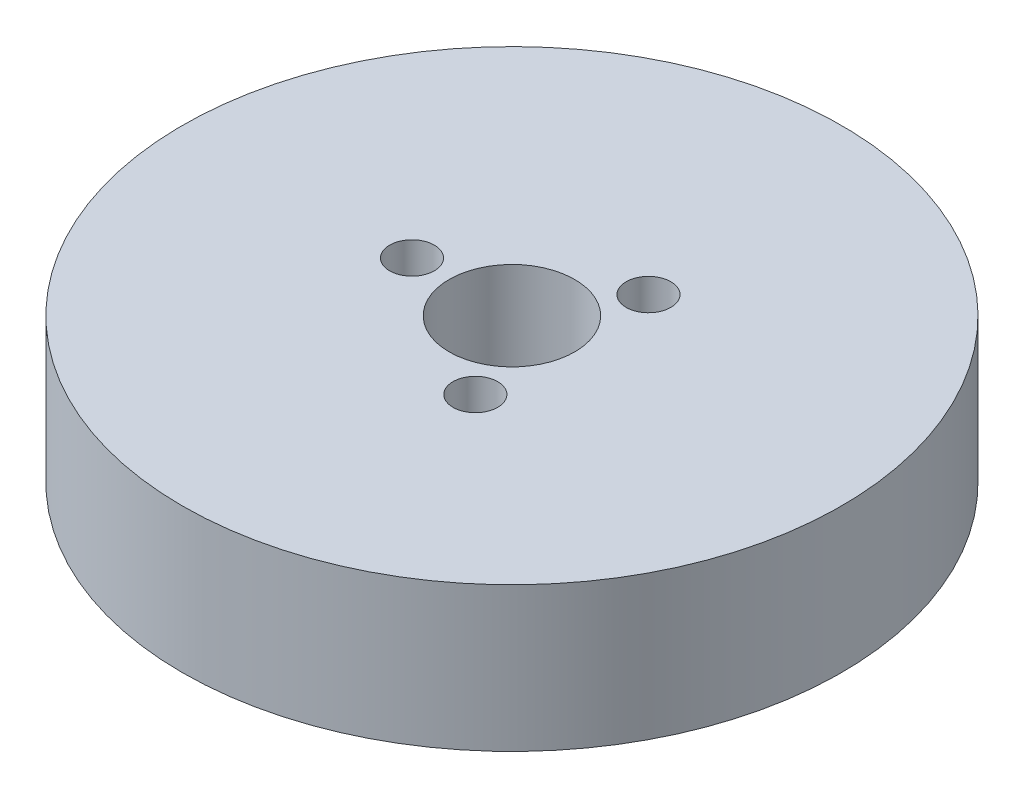
ISO-10303-21;
HEADER;
FILE_DESCRIPTION(('STEP AP214'),'2;1');
FILE_NAME('part.step','',(''),(''),'','','');
FILE_SCHEMA(('AUTOMOTIVE_DESIGN { 1 0 10303 214 1 1 1 1 }'));
ENDSEC;
DATA;
#1=APPLICATION_CONTEXT('core data for automotive mechanical design processes');
#2=APPLICATION_PROTOCOL_DEFINITION('international standard','automotive_design',2000,#1);
#3=PRODUCT_CONTEXT('',#1,'mechanical');
#4=PRODUCT('Part','Part','',(#3));
#5=PRODUCT_RELATED_PRODUCT_CATEGORY('part','',(#4));
#6=PRODUCT_DEFINITION_FORMATION('','',#4);
#7=PRODUCT_DEFINITION_CONTEXT('part definition',#1,'design');
#8=PRODUCT_DEFINITION('design','',#6,#7);
#9=PRODUCT_DEFINITION_SHAPE('','',#8);
#10=(LENGTH_UNIT() NAMED_UNIT(*) SI_UNIT(.MILLI.,.METRE.));
#11=(NAMED_UNIT(*) PLANE_ANGLE_UNIT() SI_UNIT($,.RADIAN.));
#12=(NAMED_UNIT(*) SI_UNIT($,.STERADIAN.) SOLID_ANGLE_UNIT());
#13=UNCERTAINTY_MEASURE_WITH_UNIT(LENGTH_MEASURE(1.E-05),#10,'distance_accuracy_value','');
#14=(GEOMETRIC_REPRESENTATION_CONTEXT(3) GLOBAL_UNCERTAINTY_ASSIGNED_CONTEXT((#13)) GLOBAL_UNIT_ASSIGNED_CONTEXT((#10,
#11,#12)) REPRESENTATION_CONTEXT('',''));
#15=CARTESIAN_POINT('',(0.,0.,0.));
#16=DIRECTION('',(0.,0.,1.));
#17=DIRECTION('',(1.,0.,0.));
#18=AXIS2_PLACEMENT_3D('',#15,#16,#17);
#19=CARTESIAN_POINT('',(0.,23.,0.));
#20=DIRECTION('',(0.,-1.,0.));
#21=DIRECTION('',(0.,0.,-1.));
#22=AXIS2_PLACEMENT_3D('',#19,#20,#21);
#23=CYLINDRICAL_SURFACE('',#22,52.5);
#24=CARTESIAN_POINT('',(0.,23.,0.));
#25=DIRECTION('',(0.,1.,0.));
#26=DIRECTION('',(0.,0.,1.));
#27=AXIS2_PLACEMENT_3D('',#24,#25,#26);
#28=CIRCLE('',#27,52.5);
#29=CARTESIAN_POINT('',(0.,23.,52.5));
#30=VERTEX_POINT('',#29);
#31=EDGE_CURVE('E10',#30,#30,#28,.T.);
#32=ORIENTED_EDGE('',*,*,#31,.F.);
#33=EDGE_LOOP('',(#32));
#34=FACE_BOUND('',#33,.T.);
#35=CARTESIAN_POINT('',(0.,0.,0.));
#36=DIRECTION('',(0.,1.,0.));
#37=DIRECTION('',(0.,0.,1.));
#38=AXIS2_PLACEMENT_3D('',#35,#36,#37);
#39=CIRCLE('',#38,52.5);
#40=CARTESIAN_POINT('',(0.,0.,52.5));
#41=VERTEX_POINT('',#40);
#42=EDGE_CURVE('E37',#41,#41,#39,.T.);
#43=ORIENTED_EDGE('',*,*,#42,.T.);
#44=EDGE_LOOP('',(#43));
#45=FACE_BOUND('',#44,.T.);
#46=ADVANCED_FACE('F40',(#34,#45),#23,.T.);
#47=CARTESIAN_POINT('',(0.,23.,0.));
#48=DIRECTION('',(0.,1.,0.));
#49=DIRECTION('',(0.,0.,1.));
#50=AXIS2_PLACEMENT_3D('',#47,#48,#49);
#51=PLANE('',#50);
#52=CARTESIAN_POINT('',(7.96122141789448,23.,13.7892399860986));
#53=DIRECTION('',(0.,1.,0.));
#54=DIRECTION('',(0.866025403784436,0.,-0.500000000000004));
#55=AXIS2_PLACEMENT_3D('',#52,#53,#54);
#56=CIRCLE('',#55,3.55602050568075);
#57=CARTESIAN_POINT('',(7.96122141789448,23.,17.3452604917794));
#58=VERTEX_POINT('',#57);
#59=EDGE_CURVE('E70',#58,#58,#56,.T.);
#60=ORIENTED_EDGE('',*,*,#59,.F.);
#61=EDGE_LOOP('',(#60));
#62=FACE_BOUND('',#61,.T.);
#63=CARTESIAN_POINT('',(7.96122141789428,23.,-13.7892399860987));
#64=DIRECTION('',(0.,1.,0.));
#65=DIRECTION('',(-0.866025403784443,0.,-0.499999999999992));
#66=AXIS2_PLACEMENT_3D('',#63,#64,#65);
#67=CIRCLE('',#66,3.55602050568075);
#68=CARTESIAN_POINT('',(7.96122141789428,23.,-10.233219480418));
#69=VERTEX_POINT('',#68);
#70=EDGE_CURVE('E61',#69,#69,#67,.T.);
#71=ORIENTED_EDGE('',*,*,#70,.F.);
#72=EDGE_LOOP('',(#71));
#73=FACE_BOUND('',#72,.T.);
#74=CARTESIAN_POINT('',(-15.9224428357888,23.,0.));
#75=DIRECTION('',(0.,1.,0.));
#76=DIRECTION('',(0.,0.,1.));
#77=AXIS2_PLACEMENT_3D('',#74,#75,#76);
#78=CIRCLE('',#77,3.55602050568075);
#79=CARTESIAN_POINT('',(-15.9224428357888,23.,3.55602050568075));
#80=VERTEX_POINT('',#79);
#81=EDGE_CURVE('E54',#80,#80,#78,.T.);
#82=ORIENTED_EDGE('',*,*,#81,.F.);
#83=EDGE_LOOP('',(#82));
#84=FACE_BOUND('',#83,.T.);
#85=CARTESIAN_POINT('',(0.,23.,0.));
#86=DIRECTION('',(0.,1.,0.));
#87=DIRECTION('',(0.,0.,1.));
#88=AXIS2_PLACEMENT_3D('',#85,#86,#87);
#89=CIRCLE('',#88,10.);
#90=CARTESIAN_POINT('',(0.,23.,10.));
#91=VERTEX_POINT('',#90);
#92=EDGE_CURVE('E50',#91,#91,#89,.T.);
#93=ORIENTED_EDGE('',*,*,#92,.F.);
#94=EDGE_LOOP('',(#93));
#95=FACE_BOUND('',#94,.T.);
#96=ORIENTED_EDGE('',*,*,#31,.T.);
#97=EDGE_LOOP('',(#96));
#98=FACE_BOUND('',#97,.T.);
#99=ADVANCED_FACE('F85',(#62,#73,#84,#95,#98),#51,.T.);
#100=CARTESIAN_POINT('',(0.,0.,0.));
#101=DIRECTION('',(0.,1.,0.));
#102=DIRECTION('',(0.,0.,1.));
#103=AXIS2_PLACEMENT_3D('',#100,#101,#102);
#104=PLANE('',#103);
#105=CARTESIAN_POINT('',(0.,0.,0.));
#106=DIRECTION('',(0.,1.,0.));
#107=DIRECTION('',(0.,0.,1.));
#108=AXIS2_PLACEMENT_3D('',#105,#106,#107);
#109=CIRCLE('',#108,10.);
#110=CARTESIAN_POINT('',(0.,0.,10.));
#111=VERTEX_POINT('',#110);
#112=EDGE_CURVE('E47',#111,#111,#109,.T.);
#113=ORIENTED_EDGE('',*,*,#112,.T.);
#114=EDGE_LOOP('',(#113));
#115=FACE_BOUND('',#114,.T.);
#116=ORIENTED_EDGE('',*,*,#42,.F.);
#117=EDGE_LOOP('',(#116));
#118=FACE_BOUND('',#117,.T.);
#119=ADVANCED_FACE('F84',(#115,#118),#104,.F.);
#120=CARTESIAN_POINT('',(0.,23.,0.));
#121=DIRECTION('',(0.,-1.,0.));
#122=DIRECTION('',(0.,0.,-1.));
#123=AXIS2_PLACEMENT_3D('',#120,#121,#122);
#124=CYLINDRICAL_SURFACE('',#123,10.);
#125=ORIENTED_EDGE('',*,*,#92,.T.);
#126=EDGE_LOOP('',(#125));
#127=FACE_BOUND('',#126,.T.);
#128=ORIENTED_EDGE('',*,*,#112,.F.);
#129=EDGE_LOOP('',(#128));
#130=FACE_BOUND('',#129,.T.);
#131=ADVANCED_FACE('F91',(#127,#130),#124,.F.);
#132=CARTESIAN_POINT('',(-15.9224428357888,9.19795204973279,0.));
#133=DIRECTION('',(0.,1.,0.));
#134=DIRECTION('',(0.,0.,1.));
#135=AXIS2_PLACEMENT_3D('',#132,#133,#134);
#136=CYLINDRICAL_SURFACE('',#135,3.55602050568075);
#137=CARTESIAN_POINT('',(-15.9224428357888,9.19795204973279,0.));
#138=DIRECTION('',(0.,1.,0.));
#139=DIRECTION('',(0.,0.,1.));
#140=AXIS2_PLACEMENT_3D('',#137,#138,#139);
#141=CIRCLE('',#140,3.55602050568075);
#142=CARTESIAN_POINT('',(-15.9224428357888,9.19795204973279,3.55602050568075));
#143=VERTEX_POINT('',#142);
#144=EDGE_CURVE('E55',#143,#143,#141,.T.);
#145=CARTESIAN_POINT('',(-15.9224428357888,9.19795204973279,3.55602050568075));
#146=CARTESIAN_POINT('',(-15.9224428357888,9.34172338254807,3.55602050568075));
#147=CARTESIAN_POINT('',(-15.9224428357888,9.48549471536335,3.55602050568075));
#148=CARTESIAN_POINT('',(-15.9224428357888,9.77303738099392,3.55602050568075));
#149=CARTESIAN_POINT('',(-15.9224428357888,9.9168087138092,3.55602050568075));
#150=CARTESIAN_POINT('',(-15.9224428357888,10.2043513794398,3.55602050568075));
#151=CARTESIAN_POINT('',(-15.9224428357888,10.3481227122551,3.55602050568075));
#152=CARTESIAN_POINT('',(-15.9224428357888,10.6356653778856,3.55602050568075));
#153=CARTESIAN_POINT('',(-15.9224428357888,10.7794367107009,3.55602050568075));
#154=CARTESIAN_POINT('',(-15.9224428357888,11.0669793763315,3.55602050568075));
#155=CARTESIAN_POINT('',(-15.9224428357888,11.2107507091468,3.55602050568075));
#156=CARTESIAN_POINT('',(-15.9224428357888,11.4982933747773,3.55602050568075));
#157=CARTESIAN_POINT('',(-15.9224428357888,11.6420647075926,3.55602050568075));
#158=CARTESIAN_POINT('',(-15.9224428357888,11.9296073732232,3.55602050568075));
#159=CARTESIAN_POINT('',(-15.9224428357888,12.0733787060385,3.55602050568075));
#160=CARTESIAN_POINT('',(-15.9224428357888,12.360921371669,3.55602050568075));
#161=CARTESIAN_POINT('',(-15.9224428357888,12.5046927044843,3.55602050568075));
#162=CARTESIAN_POINT('',(-15.9224428357888,12.7922353701149,3.55602050568075));
#163=CARTESIAN_POINT('',(-15.9224428357888,12.9360067029302,3.55602050568075));
#164=CARTESIAN_POINT('',(-15.9224428357888,13.2235493685607,3.55602050568075));
#165=CARTESIAN_POINT('',(-15.9224428357888,13.367320701376,3.55602050568075));
#166=CARTESIAN_POINT('',(-15.9224428357888,13.6548633670066,3.55602050568075));
#167=CARTESIAN_POINT('',(-15.9224428357888,13.7986346998219,3.55602050568075));
#168=CARTESIAN_POINT('',(-15.9224428357888,14.0861773654524,3.55602050568075));
#169=CARTESIAN_POINT('',(-15.9224428357888,14.2299486982677,3.55602050568075));
#170=CARTESIAN_POINT('',(-15.9224428357888,14.5174913638983,3.55602050568075));
#171=CARTESIAN_POINT('',(-15.9224428357888,14.6612626967136,3.55602050568075));
#172=CARTESIAN_POINT('',(-15.9224428357888,14.9488053623441,3.55602050568075));
#173=CARTESIAN_POINT('',(-15.9224428357888,15.0925766951594,3.55602050568075));
#174=CARTESIAN_POINT('',(-15.9224428357888,15.38011936079,3.55602050568075));
#175=CARTESIAN_POINT('',(-15.9224428357888,15.5238906936053,3.55602050568075));
#176=CARTESIAN_POINT('',(-15.9224428357888,15.8114333592358,3.55602050568075));
#177=CARTESIAN_POINT('',(-15.9224428357888,15.9552046920511,3.55602050568075));
#178=CARTESIAN_POINT('',(-15.9224428357888,16.2427473576817,3.55602050568075));
#179=CARTESIAN_POINT('',(-15.9224428357888,16.386518690497,3.55602050568075));
#180=CARTESIAN_POINT('',(-15.9224428357888,16.6740613561275,3.55602050568075));
#181=CARTESIAN_POINT('',(-15.9224428357888,16.8178326889428,3.55602050568075));
#182=CARTESIAN_POINT('',(-15.9224428357888,17.1053753545734,3.55602050568075));
#183=CARTESIAN_POINT('',(-15.9224428357888,17.2491466873887,3.55602050568075));
#184=CARTESIAN_POINT('',(-15.9224428357888,17.5366893530192,3.55602050568075));
#185=CARTESIAN_POINT('',(-15.9224428357888,17.6804606858345,3.55602050568075));
#186=CARTESIAN_POINT('',(-15.9224428357888,17.9680033514651,3.55602050568075));
#187=CARTESIAN_POINT('',(-15.9224428357888,18.1117746842804,3.55602050568075));
#188=CARTESIAN_POINT('',(-15.9224428357888,18.3993173499109,3.55602050568075));
#189=CARTESIAN_POINT('',(-15.9224428357888,18.5430886827262,3.55602050568075));
#190=CARTESIAN_POINT('',(-15.9224428357888,18.8306313483568,3.55602050568075));
#191=CARTESIAN_POINT('',(-15.9224428357888,18.9744026811721,3.55602050568075));
#192=CARTESIAN_POINT('',(-15.9224428357888,19.2619453468026,3.55602050568075));
#193=CARTESIAN_POINT('',(-15.9224428357888,19.4057166796179,3.55602050568075));
#194=CARTESIAN_POINT('',(-15.9224428357888,19.6932593452485,3.55602050568075));
#195=CARTESIAN_POINT('',(-15.9224428357888,19.8370306780638,3.55602050568075));
#196=CARTESIAN_POINT('',(-15.9224428357888,20.1245733436943,3.55602050568075));
#197=CARTESIAN_POINT('',(-15.9224428357888,20.2683446765096,3.55602050568075));
#198=CARTESIAN_POINT('',(-15.9224428357888,20.5558873421402,3.55602050568075));
#199=CARTESIAN_POINT('',(-15.9224428357888,20.6996586749555,3.55602050568075));
#200=CARTESIAN_POINT('',(-15.9224428357888,20.987201340586,3.55602050568075));
#201=CARTESIAN_POINT('',(-15.9224428357888,21.1309726734013,3.55602050568075));
#202=CARTESIAN_POINT('',(-15.9224428357888,21.4185153390319,3.55602050568075));
#203=CARTESIAN_POINT('',(-15.9224428357888,21.5622866718472,3.55602050568075));
#204=CARTESIAN_POINT('',(-15.9224428357888,21.8498293374777,3.55602050568075));
#205=CARTESIAN_POINT('',(-15.9224428357888,21.993600670293,3.55602050568075));
#206=CARTESIAN_POINT('',(-15.9224428357888,22.2811433359236,3.55602050568075));
#207=CARTESIAN_POINT('',(-15.9224428357888,22.4249146687389,3.55602050568075));
#208=CARTESIAN_POINT('',(-15.9224428357888,22.7124573343694,3.55602050568075));
#209=CARTESIAN_POINT('',(-15.9224428357888,22.8562286671847,3.55602050568075));
#210=CARTESIAN_POINT('',(-15.9224428357888,23.,3.55602050568075));
#211=B_SPLINE_CURVE_WITH_KNOTS('',3,(#145,#146,#147,#148,#149,#150,#151,#152,#153,#154,#155,
#156,#157,#158,#159,#160,#161,#162,#163,#164,#165,#166,#167,#168,#169,#170,#171,#172,#173,#174,
#175,#176,#177,#178,#179,#180,#181,#182,#183,#184,#185,#186,#187,#188,#189,#190,#191,#192,#193,
#194,#195,#196,#197,#198,#199,#200,#201,#202,#203,#204,#205,#206,#207,#208,#209,#210),
.UNSPECIFIED.,.F.,.F.,(4,2,2,2,2,2,2,2,2,2,2,2,2,2,2,2,2,2,2,2,2,2,2,2,2,2,2,2,2,2,2,2,4),(0.,
0.431313998445849,0.862627996891701,1.29394199533755,1.7252559937834,2.15656999222925,
2.5878839906751,3.01919798912095,3.4505119875668,3.88182598601265,4.3131399844585,
4.74445398290435,5.1757679813502,5.60708197979605,6.0383959782419,6.46970997668776,
6.90102397513361,7.33233797357945,7.76365197202531,8.19496597047116,8.62627996891701,
9.05759396736286,9.48890796580871,9.92022196425456,10.3515359627004,10.7828499611463,
11.2141639595921,11.645477958038,12.0767919564838,12.5081059549297,12.9394199533755,
13.3707339518214,13.8020479502672),.UNSPECIFIED.);
#212=EDGE_CURVE('BSEAM96',#143,#80,#211,.T.);
#213=ORIENTED_EDGE('',*,*,#144,.F.);
#214=ORIENTED_EDGE('',*,*,#81,.T.);
#215=ORIENTED_EDGE('',*,*,#212,.T.);
#216=ORIENTED_EDGE('',*,*,#212,.F.);
#217=EDGE_LOOP('',(#213,#215,#214,#216));
#218=FACE_BOUND('',#217,.T.);
#219=ADVANCED_FACE('F96',(#218),#136,.F.);
#220=CARTESIAN_POINT('',(-15.9224428357888,9.19795204973279,0.));
#221=DIRECTION('',(0.,1.,0.));
#222=DIRECTION('',(0.,0.,1.));
#223=AXIS2_PLACEMENT_3D('',#220,#221,#222);
#224=PLANE('',#223);
#225=ORIENTED_EDGE('',*,*,#144,.T.);
#226=EDGE_LOOP('',(#225));
#227=FACE_BOUND('',#226,.T.);
#228=ADVANCED_FACE('F127',(#227),#224,.T.);
#229=CARTESIAN_POINT('',(7.96122141789428,9.19795204973279,-13.7892399860987));
#230=DIRECTION('',(0.,1.,0.));
#231=DIRECTION('',(0.,0.,1.));
#232=AXIS2_PLACEMENT_3D('',#229,#230,#231);
#233=CYLINDRICAL_SURFACE('',#232,3.55602050568075);
#234=CARTESIAN_POINT('',(7.96122141789428,9.19795204973279,-13.7892399860987));
#235=DIRECTION('',(0.,1.,0.));
#236=DIRECTION('',(-0.866025403784443,0.,-0.499999999999992));
#237=AXIS2_PLACEMENT_3D('',#234,#235,#236);
#238=CIRCLE('',#237,3.55602050568075);
#239=CARTESIAN_POINT('',(7.96122141789428,9.19795204973279,-10.233219480418));
#240=VERTEX_POINT('',#239);
#241=EDGE_CURVE('E63',#240,#240,#238,.T.);
#242=CARTESIAN_POINT('',(7.96122141789428,9.19795204973279,-10.233219480418));
#243=CARTESIAN_POINT('',(7.96122141789428,9.34172338254807,-10.233219480418));
#244=CARTESIAN_POINT('',(7.96122141789428,9.48549471536335,-10.233219480418));
#245=CARTESIAN_POINT('',(7.96122141789428,9.77303738099392,-10.233219480418));
#246=CARTESIAN_POINT('',(7.96122141789428,9.9168087138092,-10.233219480418));
#247=CARTESIAN_POINT('',(7.96122141789428,10.2043513794398,-10.233219480418));
#248=CARTESIAN_POINT('',(7.96122141789428,10.3481227122551,-10.233219480418));
#249=CARTESIAN_POINT('',(7.96122141789428,10.6356653778856,-10.233219480418));
#250=CARTESIAN_POINT('',(7.96122141789428,10.7794367107009,-10.233219480418));
#251=CARTESIAN_POINT('',(7.96122141789428,11.0669793763315,-10.233219480418));
#252=CARTESIAN_POINT('',(7.96122141789428,11.2107507091468,-10.233219480418));
#253=CARTESIAN_POINT('',(7.96122141789428,11.4982933747773,-10.233219480418));
#254=CARTESIAN_POINT('',(7.96122141789428,11.6420647075926,-10.233219480418));
#255=CARTESIAN_POINT('',(7.96122141789428,11.9296073732232,-10.233219480418));
#256=CARTESIAN_POINT('',(7.96122141789428,12.0733787060385,-10.233219480418));
#257=CARTESIAN_POINT('',(7.96122141789428,12.360921371669,-10.233219480418));
#258=CARTESIAN_POINT('',(7.96122141789428,12.5046927044843,-10.233219480418));
#259=CARTESIAN_POINT('',(7.96122141789428,12.7922353701149,-10.233219480418));
#260=CARTESIAN_POINT('',(7.96122141789428,12.9360067029302,-10.233219480418));
#261=CARTESIAN_POINT('',(7.96122141789428,13.2235493685607,-10.233219480418));
#262=CARTESIAN_POINT('',(7.96122141789428,13.367320701376,-10.233219480418));
#263=CARTESIAN_POINT('',(7.96122141789428,13.6548633670066,-10.233219480418));
#264=CARTESIAN_POINT('',(7.96122141789428,13.7986346998219,-10.233219480418));
#265=CARTESIAN_POINT('',(7.96122141789428,14.0861773654524,-10.233219480418));
#266=CARTESIAN_POINT('',(7.96122141789428,14.2299486982677,-10.233219480418));
#267=CARTESIAN_POINT('',(7.96122141789428,14.5174913638983,-10.233219480418));
#268=CARTESIAN_POINT('',(7.96122141789428,14.6612626967136,-10.233219480418));
#269=CARTESIAN_POINT('',(7.96122141789428,14.9488053623441,-10.233219480418));
#270=CARTESIAN_POINT('',(7.96122141789428,15.0925766951594,-10.233219480418));
#271=CARTESIAN_POINT('',(7.96122141789428,15.38011936079,-10.233219480418));
#272=CARTESIAN_POINT('',(7.96122141789428,15.5238906936053,-10.233219480418));
#273=CARTESIAN_POINT('',(7.96122141789428,15.8114333592358,-10.233219480418));
#274=CARTESIAN_POINT('',(7.96122141789428,15.9552046920511,-10.233219480418));
#275=CARTESIAN_POINT('',(7.96122141789428,16.2427473576817,-10.233219480418));
#276=CARTESIAN_POINT('',(7.96122141789428,16.386518690497,-10.233219480418));
#277=CARTESIAN_POINT('',(7.96122141789428,16.6740613561275,-10.233219480418));
#278=CARTESIAN_POINT('',(7.96122141789428,16.8178326889428,-10.233219480418));
#279=CARTESIAN_POINT('',(7.96122141789428,17.1053753545734,-10.233219480418));
#280=CARTESIAN_POINT('',(7.96122141789428,17.2491466873887,-10.233219480418));
#281=CARTESIAN_POINT('',(7.96122141789428,17.5366893530192,-10.233219480418));
#282=CARTESIAN_POINT('',(7.96122141789428,17.6804606858345,-10.233219480418));
#283=CARTESIAN_POINT('',(7.96122141789428,17.9680033514651,-10.233219480418));
#284=CARTESIAN_POINT('',(7.96122141789428,18.1117746842804,-10.233219480418));
#285=CARTESIAN_POINT('',(7.96122141789428,18.3993173499109,-10.233219480418));
#286=CARTESIAN_POINT('',(7.96122141789428,18.5430886827262,-10.233219480418));
#287=CARTESIAN_POINT('',(7.96122141789428,18.8306313483568,-10.233219480418));
#288=CARTESIAN_POINT('',(7.96122141789428,18.9744026811721,-10.233219480418));
#289=CARTESIAN_POINT('',(7.96122141789428,19.2619453468026,-10.233219480418));
#290=CARTESIAN_POINT('',(7.96122141789428,19.4057166796179,-10.233219480418));
#291=CARTESIAN_POINT('',(7.96122141789428,19.6932593452485,-10.233219480418));
#292=CARTESIAN_POINT('',(7.96122141789428,19.8370306780638,-10.233219480418));
#293=CARTESIAN_POINT('',(7.96122141789428,20.1245733436943,-10.233219480418));
#294=CARTESIAN_POINT('',(7.96122141789428,20.2683446765096,-10.233219480418));
#295=CARTESIAN_POINT('',(7.96122141789428,20.5558873421402,-10.233219480418));
#296=CARTESIAN_POINT('',(7.96122141789428,20.6996586749555,-10.233219480418));
#297=CARTESIAN_POINT('',(7.96122141789428,20.987201340586,-10.233219480418));
#298=CARTESIAN_POINT('',(7.96122141789428,21.1309726734013,-10.233219480418));
#299=CARTESIAN_POINT('',(7.96122141789428,21.4185153390319,-10.233219480418));
#300=CARTESIAN_POINT('',(7.96122141789428,21.5622866718472,-10.233219480418));
#301=CARTESIAN_POINT('',(7.96122141789428,21.8498293374777,-10.233219480418));
#302=CARTESIAN_POINT('',(7.96122141789428,21.993600670293,-10.233219480418));
#303=CARTESIAN_POINT('',(7.96122141789428,22.2811433359236,-10.233219480418));
#304=CARTESIAN_POINT('',(7.96122141789428,22.4249146687389,-10.233219480418));
#305=CARTESIAN_POINT('',(7.96122141789428,22.7124573343694,-10.233219480418));
#306=CARTESIAN_POINT('',(7.96122141789428,22.8562286671847,-10.233219480418));
#307=CARTESIAN_POINT('',(7.96122141789428,23.,-10.233219480418));
#308=B_SPLINE_CURVE_WITH_KNOTS('',3,(#242,#243,#244,#245,#246,#247,#248,#249,#250,#251,#252,
#253,#254,#255,#256,#257,#258,#259,#260,#261,#262,#263,#264,#265,#266,#267,#268,#269,#270,#271,
#272,#273,#274,#275,#276,#277,#278,#279,#280,#281,#282,#283,#284,#285,#286,#287,#288,#289,#290,
#291,#292,#293,#294,#295,#296,#297,#298,#299,#300,#301,#302,#303,#304,#305,#306,#307),
.UNSPECIFIED.,.F.,.F.,(4,2,2,2,2,2,2,2,2,2,2,2,2,2,2,2,2,2,2,2,2,2,2,2,2,2,2,2,2,2,2,2,4),(0.,
0.431313998445849,0.862627996891701,1.29394199533755,1.7252559937834,2.15656999222925,
2.5878839906751,3.01919798912095,3.4505119875668,3.88182598601265,4.3131399844585,
4.74445398290435,5.1757679813502,5.60708197979605,6.0383959782419,6.46970997668776,
6.90102397513361,7.33233797357945,7.76365197202531,8.19496597047116,8.62627996891701,
9.05759396736286,9.48890796580871,9.92022196425456,10.3515359627004,10.7828499611463,
11.2141639595921,11.645477958038,12.0767919564838,12.5081059549297,12.9394199533755,
13.3707339518214,13.8020479502672),.UNSPECIFIED.);
#309=EDGE_CURVE('BSEAM133',#240,#69,#308,.T.);
#310=ORIENTED_EDGE('',*,*,#241,.F.);
#311=ORIENTED_EDGE('',*,*,#70,.T.);
#312=ORIENTED_EDGE('',*,*,#309,.T.);
#313=ORIENTED_EDGE('',*,*,#309,.F.);
#314=EDGE_LOOP('',(#310,#312,#311,#313));
#315=FACE_BOUND('',#314,.T.);
#316=ADVANCED_FACE('F133',(#315),#233,.F.);
#317=CARTESIAN_POINT('',(7.96122141789428,9.19795204973279,-13.7892399860987));
#318=DIRECTION('',(0.,1.,0.));
#319=DIRECTION('',(-0.866025403784443,0.,-0.499999999999992));
#320=AXIS2_PLACEMENT_3D('',#317,#318,#319);
#321=PLANE('',#320);
#322=ORIENTED_EDGE('',*,*,#241,.T.);
#323=EDGE_LOOP('',(#322));
#324=FACE_BOUND('',#323,.T.);
#325=ADVANCED_FACE('F77',(#324),#321,.T.);
#326=CARTESIAN_POINT('',(7.96122141789448,9.19795204973279,13.7892399860986));
#327=DIRECTION('',(0.,1.,0.));
#328=DIRECTION('',(0.,0.,1.));
#329=AXIS2_PLACEMENT_3D('',#326,#327,#328);
#330=CYLINDRICAL_SURFACE('',#329,3.55602050568075);
#331=CARTESIAN_POINT('',(7.96122141789448,9.19795204973279,13.7892399860986));
#332=DIRECTION('',(0.,1.,0.));
#333=DIRECTION('',(0.866025403784436,0.,-0.500000000000004));
#334=AXIS2_PLACEMENT_3D('',#331,#332,#333);
#335=CIRCLE('',#334,3.55602050568075);
#336=CARTESIAN_POINT('',(7.96122141789448,9.19795204973279,17.3452604917794));
#337=VERTEX_POINT('',#336);
#338=EDGE_CURVE('E59',#337,#337,#335,.T.);
#339=CARTESIAN_POINT('',(7.96122141789448,9.19795204973279,17.3452604917794));
#340=CARTESIAN_POINT('',(7.96122141789448,9.34172338254807,17.3452604917794));
#341=CARTESIAN_POINT('',(7.96122141789448,9.48549471536335,17.3452604917794));
#342=CARTESIAN_POINT('',(7.96122141789448,9.77303738099392,17.3452604917794));
#343=CARTESIAN_POINT('',(7.96122141789448,9.9168087138092,17.3452604917794));
#344=CARTESIAN_POINT('',(7.96122141789448,10.2043513794398,17.3452604917794));
#345=CARTESIAN_POINT('',(7.96122141789448,10.3481227122551,17.3452604917794));
#346=CARTESIAN_POINT('',(7.96122141789448,10.6356653778856,17.3452604917794));
#347=CARTESIAN_POINT('',(7.96122141789448,10.7794367107009,17.3452604917794));
#348=CARTESIAN_POINT('',(7.96122141789448,11.0669793763315,17.3452604917794));
#349=CARTESIAN_POINT('',(7.96122141789448,11.2107507091468,17.3452604917794));
#350=CARTESIAN_POINT('',(7.96122141789448,11.4982933747773,17.3452604917794));
#351=CARTESIAN_POINT('',(7.96122141789448,11.6420647075926,17.3452604917794));
#352=CARTESIAN_POINT('',(7.96122141789448,11.9296073732232,17.3452604917794));
#353=CARTESIAN_POINT('',(7.96122141789448,12.0733787060385,17.3452604917794));
#354=CARTESIAN_POINT('',(7.96122141789448,12.360921371669,17.3452604917794));
#355=CARTESIAN_POINT('',(7.96122141789448,12.5046927044843,17.3452604917794));
#356=CARTESIAN_POINT('',(7.96122141789448,12.7922353701149,17.3452604917794));
#357=CARTESIAN_POINT('',(7.96122141789448,12.9360067029302,17.3452604917794));
#358=CARTESIAN_POINT('',(7.96122141789448,13.2235493685607,17.3452604917794));
#359=CARTESIAN_POINT('',(7.96122141789448,13.367320701376,17.3452604917794));
#360=CARTESIAN_POINT('',(7.96122141789448,13.6548633670066,17.3452604917794));
#361=CARTESIAN_POINT('',(7.96122141789448,13.7986346998219,17.3452604917794));
#362=CARTESIAN_POINT('',(7.96122141789448,14.0861773654524,17.3452604917794));
#363=CARTESIAN_POINT('',(7.96122141789448,14.2299486982677,17.3452604917794));
#364=CARTESIAN_POINT('',(7.96122141789448,14.5174913638983,17.3452604917794));
#365=CARTESIAN_POINT('',(7.96122141789448,14.6612626967136,17.3452604917794));
#366=CARTESIAN_POINT('',(7.96122141789448,14.9488053623441,17.3452604917794));
#367=CARTESIAN_POINT('',(7.96122141789448,15.0925766951594,17.3452604917794));
#368=CARTESIAN_POINT('',(7.96122141789448,15.38011936079,17.3452604917794));
#369=CARTESIAN_POINT('',(7.96122141789448,15.5238906936053,17.3452604917794));
#370=CARTESIAN_POINT('',(7.96122141789448,15.8114333592358,17.3452604917794));
#371=CARTESIAN_POINT('',(7.96122141789448,15.9552046920511,17.3452604917794));
#372=CARTESIAN_POINT('',(7.96122141789448,16.2427473576817,17.3452604917794));
#373=CARTESIAN_POINT('',(7.96122141789448,16.386518690497,17.3452604917794));
#374=CARTESIAN_POINT('',(7.96122141789448,16.6740613561275,17.3452604917794));
#375=CARTESIAN_POINT('',(7.96122141789448,16.8178326889428,17.3452604917794));
#376=CARTESIAN_POINT('',(7.96122141789448,17.1053753545734,17.3452604917794));
#377=CARTESIAN_POINT('',(7.96122141789448,17.2491466873887,17.3452604917794));
#378=CARTESIAN_POINT('',(7.96122141789448,17.5366893530192,17.3452604917794));
#379=CARTESIAN_POINT('',(7.96122141789448,17.6804606858345,17.3452604917794));
#380=CARTESIAN_POINT('',(7.96122141789448,17.9680033514651,17.3452604917794));
#381=CARTESIAN_POINT('',(7.96122141789448,18.1117746842804,17.3452604917794));
#382=CARTESIAN_POINT('',(7.96122141789448,18.3993173499109,17.3452604917794));
#383=CARTESIAN_POINT('',(7.96122141789448,18.5430886827262,17.3452604917794));
#384=CARTESIAN_POINT('',(7.96122141789448,18.8306313483568,17.3452604917794));
#385=CARTESIAN_POINT('',(7.96122141789448,18.9744026811721,17.3452604917794));
#386=CARTESIAN_POINT('',(7.96122141789448,19.2619453468026,17.3452604917794));
#387=CARTESIAN_POINT('',(7.96122141789448,19.4057166796179,17.3452604917794));
#388=CARTESIAN_POINT('',(7.96122141789448,19.6932593452485,17.3452604917794));
#389=CARTESIAN_POINT('',(7.96122141789448,19.8370306780638,17.3452604917794));
#390=CARTESIAN_POINT('',(7.96122141789448,20.1245733436943,17.3452604917794));
#391=CARTESIAN_POINT('',(7.96122141789448,20.2683446765096,17.3452604917794));
#392=CARTESIAN_POINT('',(7.96122141789448,20.5558873421402,17.3452604917794));
#393=CARTESIAN_POINT('',(7.96122141789448,20.6996586749555,17.3452604917794));
#394=CARTESIAN_POINT('',(7.96122141789448,20.987201340586,17.3452604917794));
#395=CARTESIAN_POINT('',(7.96122141789448,21.1309726734013,17.3452604917794));
#396=CARTESIAN_POINT('',(7.96122141789448,21.4185153390319,17.3452604917794));
#397=CARTESIAN_POINT('',(7.96122141789448,21.5622866718472,17.3452604917794));
#398=CARTESIAN_POINT('',(7.96122141789448,21.8498293374777,17.3452604917794));
#399=CARTESIAN_POINT('',(7.96122141789448,21.993600670293,17.3452604917794));
#400=CARTESIAN_POINT('',(7.96122141789448,22.2811433359236,17.3452604917794));
#401=CARTESIAN_POINT('',(7.96122141789448,22.4249146687389,17.3452604917794));
#402=CARTESIAN_POINT('',(7.96122141789448,22.7124573343694,17.3452604917794));
#403=CARTESIAN_POINT('',(7.96122141789448,22.8562286671847,17.3452604917794));
#404=CARTESIAN_POINT('',(7.96122141789448,23.,17.3452604917794));
#405=B_SPLINE_CURVE_WITH_KNOTS('',3,(#339,#340,#341,#342,#343,#344,#345,#346,#347,#348,#349,
#350,#351,#352,#353,#354,#355,#356,#357,#358,#359,#360,#361,#362,#363,#364,#365,#366,#367,#368,
#369,#370,#371,#372,#373,#374,#375,#376,#377,#378,#379,#380,#381,#382,#383,#384,#385,#386,#387,
#388,#389,#390,#391,#392,#393,#394,#395,#396,#397,#398,#399,#400,#401,#402,#403,#404),
.UNSPECIFIED.,.F.,.F.,(4,2,2,2,2,2,2,2,2,2,2,2,2,2,2,2,2,2,2,2,2,2,2,2,2,2,2,2,2,2,2,2,4),(0.,
0.431313998445849,0.862627996891701,1.29394199533755,1.7252559937834,2.15656999222925,
2.5878839906751,3.01919798912095,3.4505119875668,3.88182598601265,4.3131399844585,
4.74445398290435,5.1757679813502,5.60708197979605,6.0383959782419,6.46970997668776,
6.90102397513361,7.33233797357945,7.76365197202531,8.19496597047116,8.62627996891701,
9.05759396736286,9.48890796580871,9.92022196425456,10.3515359627004,10.7828499611463,
11.2141639595921,11.645477958038,12.0767919564838,12.5081059549297,12.9394199533755,
13.3707339518214,13.8020479502672),.UNSPECIFIED.);
#406=EDGE_CURVE('BSEAM73',#337,#58,#405,.T.);
#407=ORIENTED_EDGE('',*,*,#338,.F.);
#408=ORIENTED_EDGE('',*,*,#59,.T.);
#409=ORIENTED_EDGE('',*,*,#406,.T.);
#410=ORIENTED_EDGE('',*,*,#406,.F.);
#411=EDGE_LOOP('',(#407,#409,#408,#410));
#412=FACE_BOUND('',#411,.T.);
#413=ADVANCED_FACE('F73',(#412),#330,.F.);
#414=CARTESIAN_POINT('',(7.96122141789448,9.19795204973279,13.7892399860986));
#415=DIRECTION('',(0.,1.,0.));
#416=DIRECTION('',(0.866025403784436,0.,-0.500000000000004));
#417=AXIS2_PLACEMENT_3D('',#414,#415,#416);
#418=PLANE('',#417);
#419=ORIENTED_EDGE('',*,*,#338,.T.);
#420=EDGE_LOOP('',(#419));
#421=FACE_BOUND('',#420,.T.);
#422=ADVANCED_FACE('F71',(#421),#418,.T.);
#423=CLOSED_SHELL('',(#46,#99,#119,#131,#219,#228,#316,#325,#413,#422));
#424=MANIFOLD_SOLID_BREP('B2',#423);
#425=ADVANCED_BREP_SHAPE_REPRESENTATION('',(#18,#424),#14);
#426=SHAPE_DEFINITION_REPRESENTATION(#9,#425);
ENDSEC;
END-ISO-10303-21;
